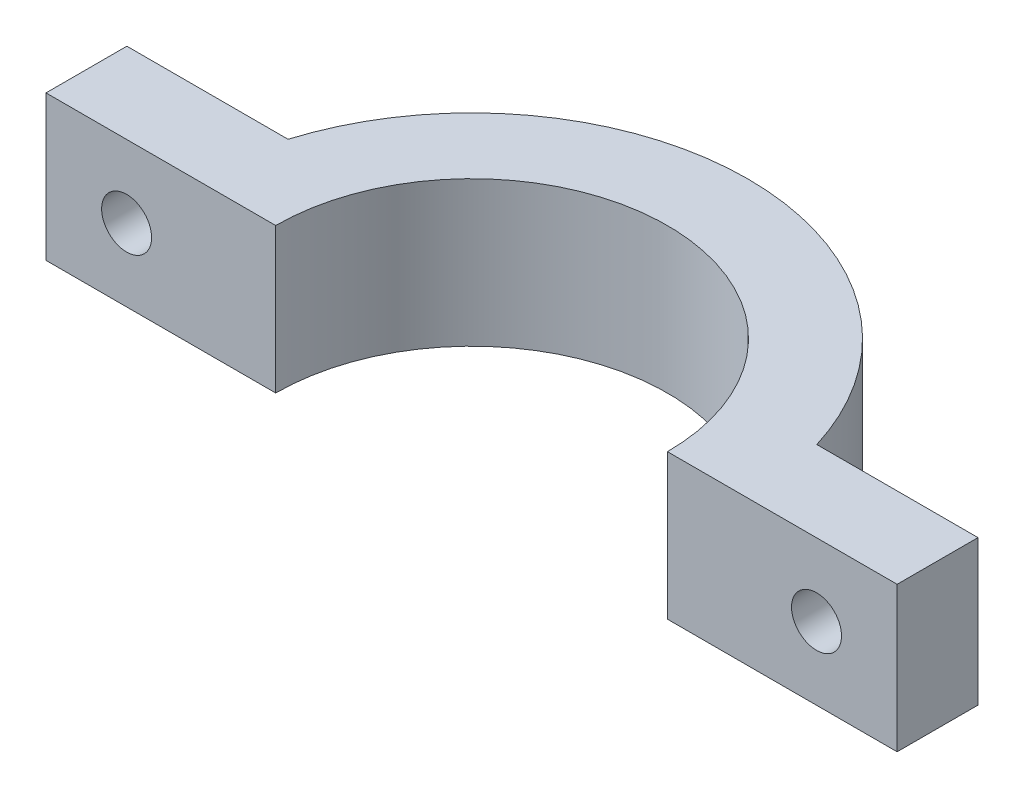
ISO-10303-21;
HEADER;
FILE_DESCRIPTION(('STEP AP214'),'2;1');
FILE_NAME('part.step','',(''),(''),'','','');
FILE_SCHEMA(('AUTOMOTIVE_DESIGN { 1 0 10303 214 1 1 1 1 }'));
ENDSEC;
DATA;
#1=APPLICATION_CONTEXT('core data for automotive mechanical design processes');
#2=APPLICATION_PROTOCOL_DEFINITION('international standard','automotive_design',2000,#1);
#3=PRODUCT_CONTEXT('',#1,'mechanical');
#4=PRODUCT('Part','Part','',(#3));
#5=PRODUCT_RELATED_PRODUCT_CATEGORY('part','',(#4));
#6=PRODUCT_DEFINITION_FORMATION('','',#4);
#7=PRODUCT_DEFINITION_CONTEXT('part definition',#1,'design');
#8=PRODUCT_DEFINITION('design','',#6,#7);
#9=PRODUCT_DEFINITION_SHAPE('','',#8);
#10=(LENGTH_UNIT() NAMED_UNIT(*) SI_UNIT(.MILLI.,.METRE.));
#11=(NAMED_UNIT(*) PLANE_ANGLE_UNIT() SI_UNIT($,.RADIAN.));
#12=(NAMED_UNIT(*) SI_UNIT($,.STERADIAN.) SOLID_ANGLE_UNIT());
#13=UNCERTAINTY_MEASURE_WITH_UNIT(LENGTH_MEASURE(1.E-05),#10,'distance_accuracy_value','');
#14=(GEOMETRIC_REPRESENTATION_CONTEXT(3) GLOBAL_UNCERTAINTY_ASSIGNED_CONTEXT((#13)) GLOBAL_UNIT_ASSIGNED_CONTEXT((#10,
#11,#12)) REPRESENTATION_CONTEXT('',''));
#15=CARTESIAN_POINT('',(0.,0.,0.));
#16=DIRECTION('',(0.,0.,1.));
#17=DIRECTION('',(1.,0.,0.));
#18=AXIS2_PLACEMENT_3D('',#15,#16,#17);
#19=CARTESIAN_POINT('',(26.4,9.,-5.01622367922326));
#20=DIRECTION('',(-1.,0.,0.));
#21=DIRECTION('',(0.,0.,1.));
#22=AXIS2_PLACEMENT_3D('',#19,#20,#21);
#23=PLANE('',#22);
#24=DIRECTION('',(0.,0.,-1.));
#25=VECTOR('',#24,1.);
#26=CARTESIAN_POINT('',(26.4,0.,-5.01622367922326));
#27=LINE('',#26,#25);
#28=CARTESIAN_POINT('',(26.4,0.,0.));
#29=VERTEX_POINT('',#28);
#30=CARTESIAN_POINT('',(26.4,0.,-5.01622367922326));
#31=VERTEX_POINT('',#30);
#32=EDGE_CURVE('E134',#29,#31,#27,.T.);
#33=ORIENTED_EDGE('',*,*,#32,.T.);
#34=DIRECTION('',(0.,-1.,0.));
#35=VECTOR('',#34,1.);
#36=CARTESIAN_POINT('',(26.4,9.,-5.01622367922326));
#37=LINE('',#36,#35);
#38=CARTESIAN_POINT('',(26.4,9.,-5.01622367922326));
#39=VERTEX_POINT('',#38);
#40=EDGE_CURVE('E11',#39,#31,#37,.T.);
#41=ORIENTED_EDGE('',*,*,#40,.F.);
#42=DIRECTION('',(0.,0.,-1.));
#43=VECTOR('',#42,1.);
#44=CARTESIAN_POINT('',(26.4,9.,-5.01622367922326));
#45=LINE('',#44,#43);
#46=CARTESIAN_POINT('',(26.4,9.,0.));
#47=VERTEX_POINT('',#46);
#48=EDGE_CURVE('E149',#47,#39,#45,.T.);
#49=ORIENTED_EDGE('',*,*,#48,.F.);
#50=DIRECTION('',(0.,-1.,0.));
#51=VECTOR('',#50,1.);
#52=CARTESIAN_POINT('',(26.4,9.,0.));
#53=LINE('',#52,#51);
#54=EDGE_CURVE('E130',#47,#29,#53,.T.);
#55=ORIENTED_EDGE('',*,*,#54,.T.);
#56=EDGE_LOOP('',(#33,#41,#49,#55));
#57=FACE_BOUND('',#56,.T.);
#58=ADVANCED_FACE('F36',(#57),#23,.F.);
#59=CARTESIAN_POINT('',(16.4,9.,-5.01622367922326));
#60=DIRECTION('',(0.,0.,1.));
#61=DIRECTION('',(1.,0.,0.));
#62=AXIS2_PLACEMENT_3D('',#59,#60,#61);
#63=PLANE('',#62);
#64=CARTESIAN_POINT('',(21.4,4.5,-5.01622367922327));
#65=DIRECTION('',(0.,0.,-1.));
#66=DIRECTION('',(-1.,0.,0.));
#67=AXIS2_PLACEMENT_3D('',#64,#65,#66);
#68=CIRCLE('',#67,1.55);
#69=CARTESIAN_POINT('',(19.85,4.5,-5.01622367922327));
#70=VERTEX_POINT('',#69);
#71=EDGE_CURVE('E161',#70,#70,#68,.T.);
#72=ORIENTED_EDGE('',*,*,#71,.F.);
#73=EDGE_LOOP('',(#72));
#74=FACE_BOUND('',#73,.T.);
#75=DIRECTION('',(-1.,0.,0.));
#76=VECTOR('',#75,1.);
#77=CARTESIAN_POINT('',(16.4,0.,-5.01622367922326));
#78=LINE('',#77,#76);
#79=CARTESIAN_POINT('',(16.4,0.,-5.01622367922326));
#80=VERTEX_POINT('',#79);
#81=EDGE_CURVE('E137',#31,#80,#78,.T.);
#82=ORIENTED_EDGE('',*,*,#81,.T.);
#83=DIRECTION('',(0.,-1.,0.));
#84=VECTOR('',#83,1.);
#85=CARTESIAN_POINT('',(16.4,9.,-5.01622367922326));
#86=LINE('',#85,#84);
#87=CARTESIAN_POINT('',(16.4,9.,-5.01622367922326));
#88=VERTEX_POINT('',#87);
#89=EDGE_CURVE('E45',#88,#80,#86,.T.);
#90=ORIENTED_EDGE('',*,*,#89,.F.);
#91=DIRECTION('',(-1.,0.,0.));
#92=VECTOR('',#91,1.);
#93=CARTESIAN_POINT('',(16.4,9.,-5.01622367922326));
#94=LINE('',#93,#92);
#95=EDGE_CURVE('E97',#39,#88,#94,.T.);
#96=ORIENTED_EDGE('',*,*,#95,.F.);
#97=ORIENTED_EDGE('',*,*,#40,.T.);
#98=EDGE_LOOP('',(#82,#90,#96,#97));
#99=FACE_BOUND('',#98,.T.);
#100=ADVANCED_FACE('F205',(#74,#99),#63,.F.);
#101=CARTESIAN_POINT('',(0.,9.,0.));
#102=DIRECTION('',(0.,-1.,0.));
#103=DIRECTION('',(0.,0.,-1.));
#104=AXIS2_PLACEMENT_3D('',#101,#102,#103);
#105=CYLINDRICAL_SURFACE('',#104,17.15);
#106=CARTESIAN_POINT('',(0.,0.,0.));
#107=DIRECTION('',(0.,1.,0.));
#108=DIRECTION('',(0.,0.,1.));
#109=AXIS2_PLACEMENT_3D('',#106,#107,#108);
#110=CIRCLE('',#109,17.15);
#111=CARTESIAN_POINT('',(-16.4,0.,-5.01622367922327));
#112=VERTEX_POINT('',#111);
#113=EDGE_CURVE('E140',#80,#112,#110,.T.);
#114=ORIENTED_EDGE('',*,*,#113,.T.);
#115=DIRECTION('',(0.,-1.,0.));
#116=VECTOR('',#115,1.);
#117=CARTESIAN_POINT('',(-16.4,9.,-5.01622367922327));
#118=LINE('',#117,#116);
#119=CARTESIAN_POINT('',(-16.4,9.,-5.01622367922327));
#120=VERTEX_POINT('',#119);
#121=EDGE_CURVE('E156',#120,#112,#118,.T.);
#122=ORIENTED_EDGE('',*,*,#121,.F.);
#123=CARTESIAN_POINT('',(0.,9.,0.));
#124=DIRECTION('',(0.,1.,0.));
#125=DIRECTION('',(0.,0.,1.));
#126=AXIS2_PLACEMENT_3D('',#123,#124,#125);
#127=CIRCLE('',#126,17.15);
#128=EDGE_CURVE('E174',#88,#120,#127,.T.);
#129=ORIENTED_EDGE('',*,*,#128,.F.);
#130=ORIENTED_EDGE('',*,*,#89,.T.);
#131=EDGE_LOOP('',(#114,#122,#129,#130));
#132=FACE_BOUND('',#131,.T.);
#133=ADVANCED_FACE('F209',(#132),#105,.T.);
#134=CARTESIAN_POINT('',(-16.4,9.,-5.01622367922326));
#135=DIRECTION('',(0.,0.,1.));
#136=DIRECTION('',(1.,0.,0.));
#137=AXIS2_PLACEMENT_3D('',#134,#135,#136);
#138=PLANE('',#137);
#139=CARTESIAN_POINT('',(-21.4,4.5,-5.01622367922327));
#140=DIRECTION('',(0.,0.,1.));
#141=DIRECTION('',(1.,0.,0.));
#142=AXIS2_PLACEMENT_3D('',#139,#140,#141);
#143=CIRCLE('',#142,1.55);
#144=CARTESIAN_POINT('',(-19.85,4.5,-5.01622367922327));
#145=VERTEX_POINT('',#144);
#146=EDGE_CURVE('E169',#145,#145,#143,.T.);
#147=ORIENTED_EDGE('',*,*,#146,.T.);
#148=EDGE_LOOP('',(#147));
#149=FACE_BOUND('',#148,.T.);
#150=DIRECTION('',(-1.,0.,0.));
#151=VECTOR('',#150,1.);
#152=CARTESIAN_POINT('',(-16.4,0.,-5.01622367922326));
#153=LINE('',#152,#151);
#154=CARTESIAN_POINT('',(-26.4,0.,-5.01622367922326));
#155=VERTEX_POINT('',#154);
#156=EDGE_CURVE('E142',#112,#155,#153,.T.);
#157=ORIENTED_EDGE('',*,*,#156,.T.);
#158=DIRECTION('',(0.,-1.,0.));
#159=VECTOR('',#158,1.);
#160=CARTESIAN_POINT('',(-26.4,9.,-5.01622367922326));
#161=LINE('',#160,#159);
#162=CARTESIAN_POINT('',(-26.4,9.,-5.01622367922326));
#163=VERTEX_POINT('',#162);
#164=EDGE_CURVE('E153',#163,#155,#161,.T.);
#165=ORIENTED_EDGE('',*,*,#164,.F.);
#166=DIRECTION('',(-1.,0.,0.));
#167=VECTOR('',#166,1.);
#168=CARTESIAN_POINT('',(-16.4,9.,-5.01622367922326));
#169=LINE('',#168,#167);
#170=EDGE_CURVE('E176',#120,#163,#169,.T.);
#171=ORIENTED_EDGE('',*,*,#170,.F.);
#172=ORIENTED_EDGE('',*,*,#121,.T.);
#173=EDGE_LOOP('',(#157,#165,#171,#172));
#174=FACE_BOUND('',#173,.T.);
#175=ADVANCED_FACE('F182',(#149,#174),#138,.F.);
#176=CARTESIAN_POINT('',(-26.4,9.,-5.01622367922326));
#177=DIRECTION('',(1.,0.,0.));
#178=DIRECTION('',(0.,0.,-1.));
#179=AXIS2_PLACEMENT_3D('',#176,#177,#178);
#180=PLANE('',#179);
#181=DIRECTION('',(0.,0.,1.));
#182=VECTOR('',#181,1.);
#183=CARTESIAN_POINT('',(-26.4,0.,-5.01622367922326));
#184=LINE('',#183,#182);
#185=CARTESIAN_POINT('',(-26.4,0.,0.));
#186=VERTEX_POINT('',#185);
#187=EDGE_CURVE('E144',#155,#186,#184,.T.);
#188=ORIENTED_EDGE('',*,*,#187,.T.);
#189=DIRECTION('',(0.,-1.,0.));
#190=VECTOR('',#189,1.);
#191=CARTESIAN_POINT('',(-26.4,9.,0.));
#192=LINE('',#191,#190);
#193=CARTESIAN_POINT('',(-26.4,9.,0.));
#194=VERTEX_POINT('',#193);
#195=EDGE_CURVE('E125',#194,#186,#192,.T.);
#196=ORIENTED_EDGE('',*,*,#195,.F.);
#197=DIRECTION('',(0.,0.,1.));
#198=VECTOR('',#197,1.);
#199=CARTESIAN_POINT('',(-26.4,9.,-5.01622367922326));
#200=LINE('',#199,#198);
#201=EDGE_CURVE('E116',#163,#194,#200,.T.);
#202=ORIENTED_EDGE('',*,*,#201,.F.);
#203=ORIENTED_EDGE('',*,*,#164,.T.);
#204=EDGE_LOOP('',(#188,#196,#202,#203));
#205=FACE_BOUND('',#204,.T.);
#206=ADVANCED_FACE('F186',(#205),#180,.F.);
#207=CARTESIAN_POINT('',(-12.15,9.,0.));
#208=DIRECTION('',(0.,0.,-1.));
#209=DIRECTION('',(-1.,0.,0.));
#210=AXIS2_PLACEMENT_3D('',#207,#208,#209);
#211=PLANE('',#210);
#212=CARTESIAN_POINT('',(-21.4,4.5,0.));
#213=DIRECTION('',(0.,0.,-1.));
#214=DIRECTION('',(-1.,0.,0.));
#215=AXIS2_PLACEMENT_3D('',#212,#213,#214);
#216=CIRCLE('',#215,1.55);
#217=CARTESIAN_POINT('',(-22.95,4.5,0.));
#218=VERTEX_POINT('',#217);
#219=EDGE_CURVE('E39',#218,#218,#216,.F.);
#220=ORIENTED_EDGE('',*,*,#219,.F.);
#221=EDGE_LOOP('',(#220));
#222=FACE_BOUND('',#221,.T.);
#223=DIRECTION('',(1.,0.,0.));
#224=VECTOR('',#223,1.);
#225=CARTESIAN_POINT('',(-12.15,0.,0.));
#226=LINE('',#225,#224);
#227=CARTESIAN_POINT('',(-12.15,0.,0.));
#228=VERTEX_POINT('',#227);
#229=EDGE_CURVE('E124',#186,#228,#226,.T.);
#230=ORIENTED_EDGE('',*,*,#229,.T.);
#231=DIRECTION('',(0.,-1.,0.));
#232=VECTOR('',#231,1.);
#233=CARTESIAN_POINT('',(-12.15,9.,0.));
#234=LINE('',#233,#232);
#235=CARTESIAN_POINT('',(-12.15,9.,0.));
#236=VERTEX_POINT('',#235);
#237=EDGE_CURVE('E121',#236,#228,#234,.T.);
#238=ORIENTED_EDGE('',*,*,#237,.F.);
#239=DIRECTION('',(1.,0.,0.));
#240=VECTOR('',#239,1.);
#241=CARTESIAN_POINT('',(-12.15,9.,0.));
#242=LINE('',#241,#240);
#243=EDGE_CURVE('E110',#194,#236,#242,.T.);
#244=ORIENTED_EDGE('',*,*,#243,.F.);
#245=ORIENTED_EDGE('',*,*,#195,.T.);
#246=EDGE_LOOP('',(#230,#238,#244,#245));
#247=FACE_BOUND('',#246,.T.);
#248=ADVANCED_FACE('F122',(#222,#247),#211,.F.);
#249=CARTESIAN_POINT('',(0.,9.,0.));
#250=DIRECTION('',(0.,-1.,0.));
#251=DIRECTION('',(0.,0.,-1.));
#252=AXIS2_PLACEMENT_3D('',#249,#250,#251);
#253=CYLINDRICAL_SURFACE('',#252,12.15);
#254=CARTESIAN_POINT('',(0.,0.,0.));
#255=DIRECTION('',(0.,-1.,0.));
#256=DIRECTION('',(0.,0.,1.));
#257=AXIS2_PLACEMENT_3D('',#254,#255,#256);
#258=CIRCLE('',#257,12.15);
#259=CARTESIAN_POINT('',(12.15,0.,0.));
#260=VERTEX_POINT('',#259);
#261=EDGE_CURVE('E83',#228,#260,#258,.T.);
#262=ORIENTED_EDGE('',*,*,#261,.T.);
#263=DIRECTION('',(0.,-1.,0.));
#264=VECTOR('',#263,1.);
#265=CARTESIAN_POINT('',(12.15,9.,0.));
#266=LINE('',#265,#264);
#267=CARTESIAN_POINT('',(12.15,9.,0.));
#268=VERTEX_POINT('',#267);
#269=EDGE_CURVE('E126',#268,#260,#266,.T.);
#270=ORIENTED_EDGE('',*,*,#269,.F.);
#271=CARTESIAN_POINT('',(0.,9.,0.));
#272=DIRECTION('',(0.,-1.,0.));
#273=DIRECTION('',(0.,0.,1.));
#274=AXIS2_PLACEMENT_3D('',#271,#272,#273);
#275=CIRCLE('',#274,12.15);
#276=EDGE_CURVE('E114',#236,#268,#275,.T.);
#277=ORIENTED_EDGE('',*,*,#276,.F.);
#278=ORIENTED_EDGE('',*,*,#237,.T.);
#279=EDGE_LOOP('',(#262,#270,#277,#278));
#280=FACE_BOUND('',#279,.T.);
#281=ADVANCED_FACE('F128',(#280),#253,.F.);
#282=CARTESIAN_POINT('',(12.15,9.,0.));
#283=DIRECTION('',(0.,0.,-1.));
#284=DIRECTION('',(-1.,0.,0.));
#285=AXIS2_PLACEMENT_3D('',#282,#283,#284);
#286=PLANE('',#285);
#287=CARTESIAN_POINT('',(21.4,4.5,0.));
#288=DIRECTION('',(0.,0.,-1.));
#289=DIRECTION('',(-1.,0.,0.));
#290=AXIS2_PLACEMENT_3D('',#287,#288,#289);
#291=CIRCLE('',#290,1.55);
#292=CARTESIAN_POINT('',(19.85,4.5,0.));
#293=VERTEX_POINT('',#292);
#294=EDGE_CURVE('E138',#293,#293,#291,.T.);
#295=ORIENTED_EDGE('',*,*,#294,.T.);
#296=EDGE_LOOP('',(#295));
#297=FACE_BOUND('',#296,.T.);
#298=DIRECTION('',(1.,0.,0.));
#299=VECTOR('',#298,1.);
#300=CARTESIAN_POINT('',(12.15,0.,0.));
#301=LINE('',#300,#299);
#302=EDGE_CURVE('E89',#260,#29,#301,.T.);
#303=ORIENTED_EDGE('',*,*,#302,.T.);
#304=ORIENTED_EDGE('',*,*,#54,.F.);
#305=DIRECTION('',(1.,0.,0.));
#306=VECTOR('',#305,1.);
#307=CARTESIAN_POINT('',(12.15,9.,0.));
#308=LINE('',#307,#306);
#309=EDGE_CURVE('E54',#268,#47,#308,.T.);
#310=ORIENTED_EDGE('',*,*,#309,.F.);
#311=ORIENTED_EDGE('',*,*,#269,.T.);
#312=EDGE_LOOP('',(#303,#304,#310,#311));
#313=FACE_BOUND('',#312,.T.);
#314=ADVANCED_FACE('F194',(#297,#313),#286,.F.);
#315=CARTESIAN_POINT('',(0.,9.,0.));
#316=DIRECTION('',(0.,1.,0.));
#317=DIRECTION('',(0.,0.,1.));
#318=AXIS2_PLACEMENT_3D('',#315,#316,#317);
#319=PLANE('',#318);
#320=ORIENTED_EDGE('',*,*,#48,.T.);
#321=ORIENTED_EDGE('',*,*,#95,.T.);
#322=ORIENTED_EDGE('',*,*,#128,.T.);
#323=ORIENTED_EDGE('',*,*,#170,.T.);
#324=ORIENTED_EDGE('',*,*,#201,.T.);
#325=ORIENTED_EDGE('',*,*,#243,.T.);
#326=ORIENTED_EDGE('',*,*,#276,.T.);
#327=ORIENTED_EDGE('',*,*,#309,.T.);
#328=EDGE_LOOP('',(#320,#321,#322,#323,#324,#325,#326,#327));
#329=FACE_BOUND('',#328,.T.);
#330=ADVANCED_FACE('F112',(#329),#319,.T.);
#331=CARTESIAN_POINT('',(0.,0.,0.));
#332=DIRECTION('',(0.,1.,0.));
#333=DIRECTION('',(0.,0.,1.));
#334=AXIS2_PLACEMENT_3D('',#331,#332,#333);
#335=PLANE('',#334);
#336=ORIENTED_EDGE('',*,*,#32,.F.);
#337=ORIENTED_EDGE('',*,*,#302,.F.);
#338=ORIENTED_EDGE('',*,*,#261,.F.);
#339=ORIENTED_EDGE('',*,*,#229,.F.);
#340=ORIENTED_EDGE('',*,*,#187,.F.);
#341=ORIENTED_EDGE('',*,*,#156,.F.);
#342=ORIENTED_EDGE('',*,*,#113,.F.);
#343=ORIENTED_EDGE('',*,*,#81,.F.);
#344=EDGE_LOOP('',(#336,#337,#338,#339,#340,#341,#342,#343));
#345=FACE_BOUND('',#344,.T.);
#346=ADVANCED_FACE('F189',(#345),#335,.F.);
#347=CARTESIAN_POINT('',(21.4,4.5,3.98377632077673));
#348=DIRECTION('',(0.,0.,-1.));
#349=DIRECTION('',(-1.,0.,0.));
#350=AXIS2_PLACEMENT_3D('',#347,#348,#349);
#351=CYLINDRICAL_SURFACE('',#350,1.55);
#352=ORIENTED_EDGE('',*,*,#71,.T.);
#353=EDGE_LOOP('',(#352));
#354=FACE_BOUND('',#353,.T.);
#355=ORIENTED_EDGE('',*,*,#294,.F.);
#356=EDGE_LOOP('',(#355));
#357=FACE_BOUND('',#356,.T.);
#358=ADVANCED_FACE('F230',(#354,#357),#351,.F.);
#359=CARTESIAN_POINT('',(-21.4,4.5,3.98377632077673));
#360=DIRECTION('',(0.,0.,-1.));
#361=DIRECTION('',(-1.,0.,0.));
#362=AXIS2_PLACEMENT_3D('',#359,#360,#361);
#363=CYLINDRICAL_SURFACE('',#362,1.55);
#364=ORIENTED_EDGE('',*,*,#146,.F.);
#365=EDGE_LOOP('',(#364));
#366=FACE_BOUND('',#365,.T.);
#367=ORIENTED_EDGE('',*,*,#219,.T.);
#368=EDGE_LOOP('',(#367));
#369=FACE_BOUND('',#368,.T.);
#370=ADVANCED_FACE('F228',(#366,#369),#363,.F.);
#371=CLOSED_SHELL('',(#58,#100,#133,#175,#206,#248,#281,#314,#330,#346,#358,#370));
#372=MANIFOLD_SOLID_BREP('B2',#371);
#373=ADVANCED_BREP_SHAPE_REPRESENTATION('',(#18,#372),#14);
#374=SHAPE_DEFINITION_REPRESENTATION(#9,#373);
ENDSEC;
END-ISO-10303-21;
